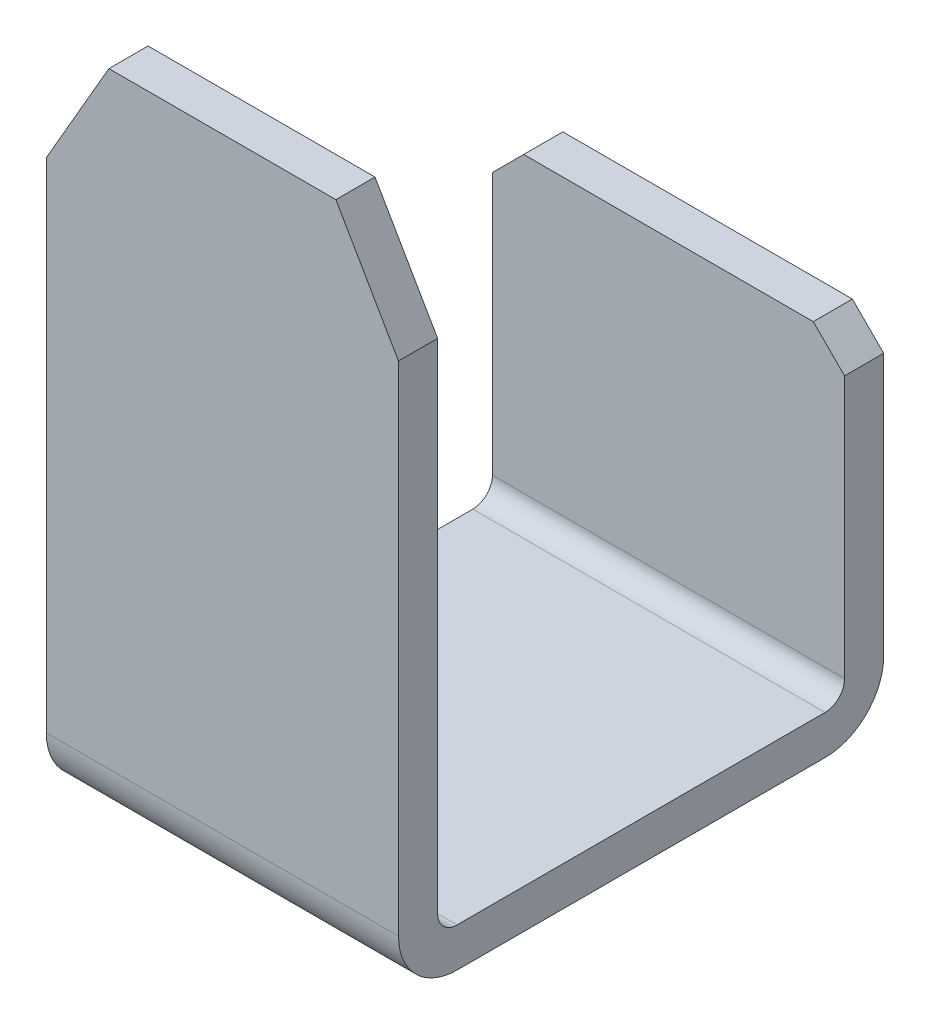
ISO-10303-21;
HEADER;
FILE_DESCRIPTION(('STEP AP214'),'2;1');
FILE_NAME('part.step','',(''),(''),'','','');
FILE_SCHEMA(('AUTOMOTIVE_DESIGN { 1 0 10303 214 1 1 1 1 }'));
ENDSEC;
DATA;
#1=APPLICATION_CONTEXT('core data for automotive mechanical design processes');
#2=APPLICATION_PROTOCOL_DEFINITION('international standard','automotive_design',2000,#1);
#3=PRODUCT_CONTEXT('',#1,'mechanical');
#4=PRODUCT('Part','Part','',(#3));
#5=PRODUCT_RELATED_PRODUCT_CATEGORY('part','',(#4));
#6=PRODUCT_DEFINITION_FORMATION('','',#4);
#7=PRODUCT_DEFINITION_CONTEXT('part definition',#1,'design');
#8=PRODUCT_DEFINITION('design','',#6,#7);
#9=PRODUCT_DEFINITION_SHAPE('','',#8);
#10=(LENGTH_UNIT() NAMED_UNIT(*) SI_UNIT(.MILLI.,.METRE.));
#11=(NAMED_UNIT(*) PLANE_ANGLE_UNIT() SI_UNIT($,.RADIAN.));
#12=(NAMED_UNIT(*) SI_UNIT($,.STERADIAN.) SOLID_ANGLE_UNIT());
#13=UNCERTAINTY_MEASURE_WITH_UNIT(LENGTH_MEASURE(1.E-05),#10,'distance_accuracy_value','');
#14=(GEOMETRIC_REPRESENTATION_CONTEXT(3) GLOBAL_UNCERTAINTY_ASSIGNED_CONTEXT((#13)) GLOBAL_UNIT_ASSIGNED_CONTEXT((#10,
#11,#12)) REPRESENTATION_CONTEXT('',''));
#15=CARTESIAN_POINT('',(0.,0.,0.));
#16=DIRECTION('',(0.,0.,1.));
#17=DIRECTION('',(1.,0.,0.));
#18=AXIS2_PLACEMENT_3D('',#15,#16,#17);
#19=CARTESIAN_POINT('',(14.2875,28.575,-19.685));
#20=DIRECTION('',(0.,0.,-1.));
#21=DIRECTION('',(0.,1.,0.));
#22=AXIS2_PLACEMENT_3D('',#19,#20,#21);
#23=PLANE('',#22);
#24=DIRECTION('',(0.,1.,0.));
#25=VECTOR('',#24,1.);
#26=CARTESIAN_POINT('',(14.2875,28.575,-19.685));
#27=LINE('',#26,#25);
#28=CARTESIAN_POINT('',(14.2875,4.76250000000002,-19.685));
#29=VERTEX_POINT('',#28);
#30=CARTESIAN_POINT('',(14.2875,26.035,-19.685));
#31=VERTEX_POINT('',#30);
#32=EDGE_CURVE('E198',#29,#31,#27,.T.);
#33=ORIENTED_EDGE('',*,*,#32,.F.);
#34=DIRECTION('',(1.,0.,0.));
#35=VECTOR('',#34,1.);
#36=CARTESIAN_POINT('',(14.2875,4.76250000000002,-19.685));
#37=LINE('',#36,#35);
#38=CARTESIAN_POINT('',(-14.2875,4.76250000000002,-19.685));
#39=VERTEX_POINT('',#38);
#40=EDGE_CURVE('E200',#39,#29,#37,.T.);
#41=ORIENTED_EDGE('',*,*,#40,.F.);
#42=DIRECTION('',(0.,1.,0.));
#43=VECTOR('',#42,1.);
#44=CARTESIAN_POINT('',(-14.2875,28.575,-19.685));
#45=LINE('',#44,#43);
#46=CARTESIAN_POINT('',(-14.2875,26.035,-19.685));
#47=VERTEX_POINT('',#46);
#48=EDGE_CURVE('E85',#39,#47,#45,.T.);
#49=ORIENTED_EDGE('',*,*,#48,.T.);
#50=DIRECTION('',(-0.707106781186548,-0.707106781186548,0.));
#51=VECTOR('',#50,1.);
#52=CARTESIAN_POINT('',(-11.7475,28.575,-19.685));
#53=LINE('',#52,#51);
#54=CARTESIAN_POINT('',(-11.7475,28.575,-19.685));
#55=VERTEX_POINT('',#54);
#56=EDGE_CURVE('E115',#55,#47,#53,.T.);
#57=ORIENTED_EDGE('',*,*,#56,.F.);
#58=DIRECTION('',(1.,0.,0.));
#59=VECTOR('',#58,1.);
#60=CARTESIAN_POINT('',(14.2875,28.575,-19.685));
#61=LINE('',#60,#59);
#62=CARTESIAN_POINT('',(11.7475,28.575,-19.685));
#63=VERTEX_POINT('',#62);
#64=EDGE_CURVE('E119',#55,#63,#61,.T.);
#65=ORIENTED_EDGE('',*,*,#64,.T.);
#66=DIRECTION('',(0.707106781186549,-0.707106781186547,0.));
#67=VECTOR('',#66,1.);
#68=CARTESIAN_POINT('',(14.2875,26.035,-19.685));
#69=LINE('',#68,#67);
#70=EDGE_CURVE('E143',#63,#31,#69,.T.);
#71=ORIENTED_EDGE('',*,*,#70,.T.);
#72=EDGE_LOOP('',(#33,#41,#49,#57,#65,#71));
#73=FACE_BOUND('',#72,.T.);
#74=ADVANCED_FACE('F16',(#73),#23,.T.);
#75=CARTESIAN_POINT('',(-11.7475,28.575,-16.51));
#76=DIRECTION('',(-0.707106781186548,0.707106781186548,0.));
#77=DIRECTION('',(-0.707106781186548,-0.707106781186548,0.));
#78=AXIS2_PLACEMENT_3D('',#75,#76,#77);
#79=PLANE('',#78);
#80=DIRECTION('',(0.,0.,-1.));
#81=VECTOR('',#80,1.);
#82=CARTESIAN_POINT('',(-14.2875,26.035,-16.51));
#83=LINE('',#82,#81);
#84=CARTESIAN_POINT('',(-14.2875,26.035,-16.51));
#85=VERTEX_POINT('',#84);
#86=EDGE_CURVE('E204',#47,#85,#83,.F.);
#87=ORIENTED_EDGE('',*,*,#86,.T.);
#88=DIRECTION('',(0.707106781186548,0.707106781186547,0.));
#89=VECTOR('',#88,1.);
#90=CARTESIAN_POINT('',(-14.2875,26.035,-16.51));
#91=LINE('',#90,#89);
#92=CARTESIAN_POINT('',(-11.7475,28.575,-16.51));
#93=VERTEX_POINT('',#92);
#94=EDGE_CURVE('E135',#85,#93,#91,.T.);
#95=ORIENTED_EDGE('',*,*,#94,.T.);
#96=DIRECTION('',(0.,0.,-1.));
#97=VECTOR('',#96,1.);
#98=CARTESIAN_POINT('',(-11.7475,28.575,-16.51));
#99=LINE('',#98,#97);
#100=EDGE_CURVE('E124',#93,#55,#99,.T.);
#101=ORIENTED_EDGE('',*,*,#100,.T.);
#102=ORIENTED_EDGE('',*,*,#56,.T.);
#103=EDGE_LOOP('',(#87,#95,#101,#102));
#104=FACE_BOUND('',#103,.T.);
#105=ADVANCED_FACE('F134',(#104),#79,.T.);
#106=CARTESIAN_POINT('',(14.2875,28.575,-16.51));
#107=DIRECTION('',(0.,-1.,0.));
#108=DIRECTION('',(0.,0.,-1.));
#109=AXIS2_PLACEMENT_3D('',#106,#107,#108);
#110=PLANE('',#109);
#111=ORIENTED_EDGE('',*,*,#64,.F.);
#112=ORIENTED_EDGE('',*,*,#100,.F.);
#113=DIRECTION('',(1.,0.,0.));
#114=VECTOR('',#113,1.);
#115=CARTESIAN_POINT('',(14.2875,28.575,-16.51));
#116=LINE('',#115,#114);
#117=CARTESIAN_POINT('',(11.7475,28.575,-16.51));
#118=VERTEX_POINT('',#117);
#119=EDGE_CURVE('E212',#93,#118,#116,.T.);
#120=ORIENTED_EDGE('',*,*,#119,.T.);
#121=DIRECTION('',(0.,0.,1.));
#122=VECTOR('',#121,1.);
#123=CARTESIAN_POINT('',(11.7475,28.575,-16.51));
#124=LINE('',#123,#122);
#125=EDGE_CURVE('E131',#118,#63,#124,.F.);
#126=ORIENTED_EDGE('',*,*,#125,.T.);
#127=EDGE_LOOP('',(#111,#112,#120,#126));
#128=FACE_BOUND('',#127,.T.);
#129=ADVANCED_FACE('F128',(#128),#110,.F.);
#130=CARTESIAN_POINT('',(14.2875,26.035,-16.51));
#131=DIRECTION('',(-0.707106781186547,-0.707106781186549,0.));
#132=DIRECTION('',(0.707106781186549,-0.707106781186547,0.));
#133=AXIS2_PLACEMENT_3D('',#130,#131,#132);
#134=PLANE('',#133);
#135=ORIENTED_EDGE('',*,*,#70,.F.);
#136=ORIENTED_EDGE('',*,*,#125,.F.);
#137=DIRECTION('',(0.707106781186549,-0.707106781186547,0.));
#138=VECTOR('',#137,1.);
#139=CARTESIAN_POINT('',(11.7475,28.575,-16.51));
#140=LINE('',#139,#138);
#141=CARTESIAN_POINT('',(14.2875,26.035,-16.51));
#142=VERTEX_POINT('',#141);
#143=EDGE_CURVE('E191',#118,#142,#140,.T.);
#144=ORIENTED_EDGE('',*,*,#143,.T.);
#145=DIRECTION('',(0.,0.,-1.));
#146=VECTOR('',#145,1.);
#147=CARTESIAN_POINT('',(14.2875,26.035,-16.51));
#148=LINE('',#147,#146);
#149=EDGE_CURVE('E92',#31,#142,#148,.F.);
#150=ORIENTED_EDGE('',*,*,#149,.F.);
#151=EDGE_LOOP('',(#135,#136,#144,#150));
#152=FACE_BOUND('',#151,.T.);
#153=ADVANCED_FACE('F228',(#152),#134,.F.);
#154=CARTESIAN_POINT('',(14.2875,4.76250000000002,-14.9225));
#155=DIRECTION('',(1.,0.,0.));
#156=DIRECTION('',(0.,0.,-1.));
#157=AXIS2_PLACEMENT_3D('',#154,#155,#156);
#158=CYLINDRICAL_SURFACE('',#157,4.7625);
#159=CARTESIAN_POINT('',(-14.2875,4.76250000000002,-14.9225));
#160=DIRECTION('',(1.,0.,0.));
#161=DIRECTION('',(0.,0.,-1.));
#162=AXIS2_PLACEMENT_3D('',#159,#160,#161);
#163=CIRCLE('',#162,4.7625);
#164=CARTESIAN_POINT('',(-14.2875,0.,-14.9225));
#165=VERTEX_POINT('',#164);
#166=EDGE_CURVE('E19',#39,#165,#163,.F.);
#167=ORIENTED_EDGE('',*,*,#166,.F.);
#168=ORIENTED_EDGE('',*,*,#40,.T.);
#169=CARTESIAN_POINT('',(14.2875,4.76250000000002,-14.9225));
#170=DIRECTION('',(1.,0.,0.));
#171=DIRECTION('',(0.,0.,-1.));
#172=AXIS2_PLACEMENT_3D('',#169,#170,#171);
#173=CIRCLE('',#172,4.7625);
#174=CARTESIAN_POINT('',(14.2875,0.,-14.9225));
#175=VERTEX_POINT('',#174);
#176=EDGE_CURVE('E173',#175,#29,#173,.T.);
#177=ORIENTED_EDGE('',*,*,#176,.F.);
#178=DIRECTION('',(1.,0.,0.));
#179=VECTOR('',#178,1.);
#180=CARTESIAN_POINT('',(14.2875,0.,-14.9225));
#181=LINE('',#180,#179);
#182=EDGE_CURVE('E175',#165,#175,#181,.T.);
#183=ORIENTED_EDGE('',*,*,#182,.F.);
#184=EDGE_LOOP('',(#167,#168,#177,#183));
#185=FACE_BOUND('',#184,.T.);
#186=ADVANCED_FACE('F286',(#185),#158,.T.);
#187=CARTESIAN_POINT('',(14.2875,28.575,-16.51));
#188=DIRECTION('',(0.,0.,-1.));
#189=DIRECTION('',(0.,1.,0.));
#190=AXIS2_PLACEMENT_3D('',#187,#188,#189);
#191=PLANE('',#190);
#192=DIRECTION('',(1.,0.,0.));
#193=VECTOR('',#192,1.);
#194=CARTESIAN_POINT('',(14.2875,4.76250000000002,-16.51));
#195=LINE('',#194,#193);
#196=CARTESIAN_POINT('',(-14.2875,4.76250000000002,-16.51));
#197=VERTEX_POINT('',#196);
#198=CARTESIAN_POINT('',(14.2875,4.76250000000002,-16.51));
#199=VERTEX_POINT('',#198);
#200=EDGE_CURVE('E170',#197,#199,#195,.T.);
#201=ORIENTED_EDGE('',*,*,#200,.T.);
#202=DIRECTION('',(0.,1.,0.));
#203=VECTOR('',#202,1.);
#204=CARTESIAN_POINT('',(14.2875,28.575,-16.51));
#205=LINE('',#204,#203);
#206=EDGE_CURVE('E189',#142,#199,#205,.F.);
#207=ORIENTED_EDGE('',*,*,#206,.F.);
#208=ORIENTED_EDGE('',*,*,#143,.F.);
#209=ORIENTED_EDGE('',*,*,#119,.F.);
#210=ORIENTED_EDGE('',*,*,#94,.F.);
#211=DIRECTION('',(0.,1.,0.));
#212=VECTOR('',#211,1.);
#213=CARTESIAN_POINT('',(-14.2875,28.575,-16.51));
#214=LINE('',#213,#212);
#215=EDGE_CURVE('E183',#197,#85,#214,.T.);
#216=ORIENTED_EDGE('',*,*,#215,.F.);
#217=EDGE_LOOP('',(#201,#207,#208,#209,#210,#216));
#218=FACE_BOUND('',#217,.T.);
#219=ADVANCED_FACE('F226',(#218),#191,.F.);
#220=CARTESIAN_POINT('',(14.2875,0.,-16.51));
#221=DIRECTION('',(0.,-1.,0.));
#222=DIRECTION('',(0.,0.,-1.));
#223=AXIS2_PLACEMENT_3D('',#220,#221,#222);
#224=PLANE('',#223);
#225=DIRECTION('',(0.,0.,-1.));
#226=VECTOR('',#225,1.);
#227=CARTESIAN_POINT('',(14.2875,0.,-16.51));
#228=LINE('',#227,#226);
#229=CARTESIAN_POINT('',(14.2875,0.,14.9225));
#230=VERTEX_POINT('',#229);
#231=EDGE_CURVE('E166',#230,#175,#228,.T.);
#232=ORIENTED_EDGE('',*,*,#231,.F.);
#233=DIRECTION('',(1.,0.,0.));
#234=VECTOR('',#233,1.);
#235=CARTESIAN_POINT('',(14.2875,0.,14.9225));
#236=LINE('',#235,#234);
#237=CARTESIAN_POINT('',(-14.2875,0.,14.9225));
#238=VERTEX_POINT('',#237);
#239=EDGE_CURVE('E417',#238,#230,#236,.T.);
#240=ORIENTED_EDGE('',*,*,#239,.F.);
#241=DIRECTION('',(0.,0.,-1.));
#242=VECTOR('',#241,1.);
#243=CARTESIAN_POINT('',(-14.2875,0.,-16.51));
#244=LINE('',#243,#242);
#245=EDGE_CURVE('E169',#238,#165,#244,.T.);
#246=ORIENTED_EDGE('',*,*,#245,.T.);
#247=ORIENTED_EDGE('',*,*,#182,.T.);
#248=EDGE_LOOP('',(#232,#240,#246,#247));
#249=FACE_BOUND('',#248,.T.);
#250=ADVANCED_FACE('F280',(#249),#224,.T.);
#251=CARTESIAN_POINT('',(14.2875,4.76250000000002,-14.9225));
#252=DIRECTION('',(1.,0.,0.));
#253=DIRECTION('',(0.,0.,-1.));
#254=AXIS2_PLACEMENT_3D('',#251,#252,#253);
#255=CYLINDRICAL_SURFACE('',#254,1.5875);
#256=ORIENTED_EDGE('',*,*,#200,.F.);
#257=CARTESIAN_POINT('',(-14.2875,4.76250000000002,-14.9225));
#258=DIRECTION('',(1.,0.,0.));
#259=DIRECTION('',(0.,0.,-1.));
#260=AXIS2_PLACEMENT_3D('',#257,#258,#259);
#261=CIRCLE('',#260,1.5875);
#262=CARTESIAN_POINT('',(-14.2875,3.17500000000002,-14.9225));
#263=VERTEX_POINT('',#262);
#264=EDGE_CURVE('E171',#263,#197,#261,.T.);
#265=ORIENTED_EDGE('',*,*,#264,.F.);
#266=DIRECTION('',(1.,0.,0.));
#267=VECTOR('',#266,1.);
#268=CARTESIAN_POINT('',(14.2875,3.17500000000002,-14.9225));
#269=LINE('',#268,#267);
#270=CARTESIAN_POINT('',(14.2875,3.17500000000002,-14.9225));
#271=VERTEX_POINT('',#270);
#272=EDGE_CURVE('E165',#263,#271,#269,.T.);
#273=ORIENTED_EDGE('',*,*,#272,.T.);
#274=CARTESIAN_POINT('',(14.2875,4.76250000000002,-14.9225));
#275=DIRECTION('',(1.,0.,0.));
#276=DIRECTION('',(0.,0.,-1.));
#277=AXIS2_PLACEMENT_3D('',#274,#275,#276);
#278=CIRCLE('',#277,1.5875);
#279=EDGE_CURVE('E167',#199,#271,#278,.F.);
#280=ORIENTED_EDGE('',*,*,#279,.F.);
#281=EDGE_LOOP('',(#256,#265,#273,#280));
#282=FACE_BOUND('',#281,.T.);
#283=ADVANCED_FACE('F276',(#282),#255,.F.);
#284=CARTESIAN_POINT('',(14.2875,4.7625,14.9225));
#285=DIRECTION('',(1.,0.,0.));
#286=DIRECTION('',(0.,0.,-1.));
#287=AXIS2_PLACEMENT_3D('',#284,#285,#286);
#288=CYLINDRICAL_SURFACE('',#287,4.7625);
#289=CARTESIAN_POINT('',(-14.2875,4.7625,14.9225));
#290=DIRECTION('',(1.,0.,0.));
#291=DIRECTION('',(0.,0.,-1.));
#292=AXIS2_PLACEMENT_3D('',#289,#290,#291);
#293=CIRCLE('',#292,4.7625);
#294=CARTESIAN_POINT('',(-14.2875,4.7625,19.685));
#295=VERTEX_POINT('',#294);
#296=EDGE_CURVE('E163',#238,#295,#293,.F.);
#297=ORIENTED_EDGE('',*,*,#296,.F.);
#298=ORIENTED_EDGE('',*,*,#239,.T.);
#299=CARTESIAN_POINT('',(14.2875,4.7625,14.9225));
#300=DIRECTION('',(1.,0.,0.));
#301=DIRECTION('',(0.,0.,-1.));
#302=AXIS2_PLACEMENT_3D('',#299,#300,#301);
#303=CIRCLE('',#302,4.7625);
#304=CARTESIAN_POINT('',(14.2875,4.7625,19.685));
#305=VERTEX_POINT('',#304);
#306=EDGE_CURVE('E158',#305,#230,#303,.T.);
#307=ORIENTED_EDGE('',*,*,#306,.F.);
#308=DIRECTION('',(1.,0.,0.));
#309=VECTOR('',#308,1.);
#310=CARTESIAN_POINT('',(14.2875,4.7625,19.685));
#311=LINE('',#310,#309);
#312=EDGE_CURVE('E162',#295,#305,#311,.T.);
#313=ORIENTED_EDGE('',*,*,#312,.F.);
#314=EDGE_LOOP('',(#297,#298,#307,#313));
#315=FACE_BOUND('',#314,.T.);
#316=ADVANCED_FACE('F272',(#315),#288,.T.);
#317=CARTESIAN_POINT('',(14.2875,3.17500000000002,-16.51));
#318=DIRECTION('',(0.,-1.,0.));
#319=DIRECTION('',(0.,0.,-1.));
#320=AXIS2_PLACEMENT_3D('',#317,#318,#319);
#321=PLANE('',#320);
#322=DIRECTION('',(1.,0.,0.));
#323=VECTOR('',#322,1.);
#324=CARTESIAN_POINT('',(14.2875,3.175,14.9225));
#325=LINE('',#324,#323);
#326=CARTESIAN_POINT('',(-14.2875,3.175,14.9225));
#327=VERTEX_POINT('',#326);
#328=CARTESIAN_POINT('',(14.2875,3.175,14.9225));
#329=VERTEX_POINT('',#328);
#330=EDGE_CURVE('E153',#327,#329,#325,.T.);
#331=ORIENTED_EDGE('',*,*,#330,.T.);
#332=DIRECTION('',(0.,0.,-1.));
#333=VECTOR('',#332,1.);
#334=CARTESIAN_POINT('',(14.2875,3.17500000000002,-16.51));
#335=LINE('',#334,#333);
#336=EDGE_CURVE('E465',#271,#329,#335,.F.);
#337=ORIENTED_EDGE('',*,*,#336,.F.);
#338=ORIENTED_EDGE('',*,*,#272,.F.);
#339=DIRECTION('',(0.,0.,-1.));
#340=VECTOR('',#339,1.);
#341=CARTESIAN_POINT('',(-14.2875,3.17500000000002,-16.51));
#342=LINE('',#341,#340);
#343=EDGE_CURVE('E420',#327,#263,#342,.T.);
#344=ORIENTED_EDGE('',*,*,#343,.F.);
#345=EDGE_LOOP('',(#331,#337,#338,#344));
#346=FACE_BOUND('',#345,.T.);
#347=ADVANCED_FACE('F268',(#346),#321,.F.);
#348=CARTESIAN_POINT('',(14.2875,3.175,19.685));
#349=DIRECTION('',(0.,0.,1.));
#350=DIRECTION('',(0.,-1.,0.));
#351=AXIS2_PLACEMENT_3D('',#348,#349,#350);
#352=PLANE('',#351);
#353=DIRECTION('',(0.,1.,0.));
#354=VECTOR('',#353,1.);
#355=CARTESIAN_POINT('',(-14.2875,3.175,19.685));
#356=LINE('',#355,#354);
#357=CARTESIAN_POINT('',(-14.2875,45.1761818975501,19.685));
#358=VERTEX_POINT('',#357);
#359=EDGE_CURVE('E157',#358,#295,#356,.F.);
#360=ORIENTED_EDGE('',*,*,#359,.T.);
#361=ORIENTED_EDGE('',*,*,#312,.T.);
#362=DIRECTION('',(0.,1.,0.));
#363=VECTOR('',#362,1.);
#364=CARTESIAN_POINT('',(14.2875,3.175,19.685));
#365=LINE('',#364,#363);
#366=CARTESIAN_POINT('',(14.2875,45.1761818975501,19.685));
#367=VERTEX_POINT('',#366);
#368=EDGE_CURVE('E234',#367,#305,#365,.F.);
#369=ORIENTED_EDGE('',*,*,#368,.F.);
#370=DIRECTION('',(0.500000000000002,-0.866025403784437,0.));
#371=VECTOR('',#370,1.);
#372=CARTESIAN_POINT('',(14.2875,45.1761818975501,19.685));
#373=LINE('',#372,#371);
#374=CARTESIAN_POINT('',(9.20749999999998,53.975,19.685));
#375=VERTEX_POINT('',#374);
#376=EDGE_CURVE('E161',#367,#375,#373,.F.);
#377=ORIENTED_EDGE('',*,*,#376,.T.);
#378=DIRECTION('',(1.,0.,0.));
#379=VECTOR('',#378,1.);
#380=CARTESIAN_POINT('',(14.2875,53.975,19.685));
#381=LINE('',#380,#379);
#382=CARTESIAN_POINT('',(-9.20749999999998,53.975,19.685));
#383=VERTEX_POINT('',#382);
#384=EDGE_CURVE('E451',#383,#375,#381,.T.);
#385=ORIENTED_EDGE('',*,*,#384,.F.);
#386=DIRECTION('',(-0.500000000000002,-0.866025403784437,0.));
#387=VECTOR('',#386,1.);
#388=CARTESIAN_POINT('',(-9.20749999999998,53.975,19.685));
#389=LINE('',#388,#387);
#390=EDGE_CURVE('E425',#358,#383,#389,.F.);
#391=ORIENTED_EDGE('',*,*,#390,.F.);
#392=EDGE_LOOP('',(#360,#361,#369,#377,#385,#391));
#393=FACE_BOUND('',#392,.T.);
#394=ADVANCED_FACE('F264',(#393),#352,.T.);
#395=CARTESIAN_POINT('',(14.2875,45.1761818975501,16.51));
#396=DIRECTION('',(-0.866025403784437,-0.500000000000002,0.));
#397=DIRECTION('',(0.500000000000002,-0.866025403784437,0.));
#398=AXIS2_PLACEMENT_3D('',#395,#396,#397);
#399=PLANE('',#398);
#400=ORIENTED_EDGE('',*,*,#376,.F.);
#401=DIRECTION('',(0.,0.,-1.));
#402=VECTOR('',#401,1.);
#403=CARTESIAN_POINT('',(14.2875,45.1761818975501,16.51));
#404=LINE('',#403,#402);
#405=CARTESIAN_POINT('',(14.2875,45.1761818975501,16.51));
#406=VERTEX_POINT('',#405);
#407=EDGE_CURVE('E152',#406,#367,#404,.F.);
#408=ORIENTED_EDGE('',*,*,#407,.F.);
#409=DIRECTION('',(-0.500000000000002,0.866025403784438,0.));
#410=VECTOR('',#409,1.);
#411=CARTESIAN_POINT('',(14.2875,45.1761818975501,16.51));
#412=LINE('',#411,#410);
#413=CARTESIAN_POINT('',(9.20749999999998,53.975,16.51));
#414=VERTEX_POINT('',#413);
#415=EDGE_CURVE('E489',#406,#414,#412,.T.);
#416=ORIENTED_EDGE('',*,*,#415,.T.);
#417=DIRECTION('',(0.,0.,1.));
#418=VECTOR('',#417,1.);
#419=CARTESIAN_POINT('',(9.20749999999998,53.975,16.51));
#420=LINE('',#419,#418);
#421=EDGE_CURVE('E441',#375,#414,#420,.F.);
#422=ORIENTED_EDGE('',*,*,#421,.F.);
#423=EDGE_LOOP('',(#400,#408,#416,#422));
#424=FACE_BOUND('',#423,.T.);
#425=ADVANCED_FACE('F260',(#424),#399,.F.);
#426=CARTESIAN_POINT('',(14.2875,53.975,16.51));
#427=DIRECTION('',(0.,1.,0.));
#428=DIRECTION('',(0.,0.,1.));
#429=AXIS2_PLACEMENT_3D('',#426,#427,#428);
#430=PLANE('',#429);
#431=ORIENTED_EDGE('',*,*,#421,.T.);
#432=DIRECTION('',(1.,0.,0.));
#433=VECTOR('',#432,1.);
#434=CARTESIAN_POINT('',(14.2875,53.975,16.51));
#435=LINE('',#434,#433);
#436=CARTESIAN_POINT('',(-9.20749999999998,53.975,16.51));
#437=VERTEX_POINT('',#436);
#438=EDGE_CURVE('E448',#414,#437,#435,.F.);
#439=ORIENTED_EDGE('',*,*,#438,.T.);
#440=DIRECTION('',(0.,0.,1.));
#441=VECTOR('',#440,1.);
#442=CARTESIAN_POINT('',(-9.20749999999998,53.975,16.51));
#443=LINE('',#442,#441);
#444=EDGE_CURVE('E430',#383,#437,#443,.F.);
#445=ORIENTED_EDGE('',*,*,#444,.F.);
#446=ORIENTED_EDGE('',*,*,#384,.T.);
#447=EDGE_LOOP('',(#431,#439,#445,#446));
#448=FACE_BOUND('',#447,.T.);
#449=ADVANCED_FACE('F256',(#448),#430,.T.);
#450=CARTESIAN_POINT('',(-9.20749999999998,53.975,16.51));
#451=DIRECTION('',(-0.866025403784437,0.500000000000002,0.));
#452=DIRECTION('',(-0.500000000000002,-0.866025403784437,0.));
#453=AXIS2_PLACEMENT_3D('',#450,#451,#452);
#454=PLANE('',#453);
#455=ORIENTED_EDGE('',*,*,#444,.T.);
#456=DIRECTION('',(-0.500000000000002,-0.866025403784437,0.));
#457=VECTOR('',#456,1.);
#458=CARTESIAN_POINT('',(-9.20749999999998,53.975,16.51));
#459=LINE('',#458,#457);
#460=CARTESIAN_POINT('',(-14.2875,45.1761818975501,16.51));
#461=VERTEX_POINT('',#460);
#462=EDGE_CURVE('E444',#437,#461,#459,.T.);
#463=ORIENTED_EDGE('',*,*,#462,.T.);
#464=DIRECTION('',(0.,0.,-1.));
#465=VECTOR('',#464,1.);
#466=CARTESIAN_POINT('',(-14.2875,45.1761818975501,16.51));
#467=LINE('',#466,#465);
#468=EDGE_CURVE('E428',#461,#358,#467,.F.);
#469=ORIENTED_EDGE('',*,*,#468,.T.);
#470=ORIENTED_EDGE('',*,*,#390,.T.);
#471=EDGE_LOOP('',(#455,#463,#469,#470));
#472=FACE_BOUND('',#471,.T.);
#473=ADVANCED_FACE('F253',(#472),#454,.T.);
#474=CARTESIAN_POINT('',(-14.2875,3.175,16.51));
#475=DIRECTION('',(1.,0.,0.));
#476=DIRECTION('',(0.,0.,-1.));
#477=AXIS2_PLACEMENT_3D('',#474,#475,#476);
#478=PLANE('',#477);
#479=ORIENTED_EDGE('',*,*,#359,.F.);
#480=ORIENTED_EDGE('',*,*,#468,.F.);
#481=DIRECTION('',(0.,-1.,0.));
#482=VECTOR('',#481,1.);
#483=CARTESIAN_POINT('',(-14.2875,3.175,16.51));
#484=LINE('',#483,#482);
#485=CARTESIAN_POINT('',(-14.2875,4.7625,16.51));
#486=VERTEX_POINT('',#485);
#487=EDGE_CURVE('E447',#461,#486,#484,.T.);
#488=ORIENTED_EDGE('',*,*,#487,.T.);
#489=CARTESIAN_POINT('',(-14.2875,4.7625,14.9225));
#490=DIRECTION('',(1.,0.,0.));
#491=DIRECTION('',(0.,0.,-1.));
#492=AXIS2_PLACEMENT_3D('',#489,#490,#491);
#493=CIRCLE('',#492,1.5875);
#494=EDGE_CURVE('E154',#486,#327,#493,.T.);
#495=ORIENTED_EDGE('',*,*,#494,.T.);
#496=ORIENTED_EDGE('',*,*,#343,.T.);
#497=ORIENTED_EDGE('',*,*,#264,.T.);
#498=ORIENTED_EDGE('',*,*,#215,.T.);
#499=ORIENTED_EDGE('',*,*,#86,.F.);
#500=ORIENTED_EDGE('',*,*,#48,.F.);
#501=ORIENTED_EDGE('',*,*,#166,.T.);
#502=ORIENTED_EDGE('',*,*,#245,.F.);
#503=ORIENTED_EDGE('',*,*,#296,.T.);
#504=EDGE_LOOP('',(#479,#480,#488,#495,#496,#497,#498,#499,#500,#501,#502,#503));
#505=FACE_BOUND('',#504,.T.);
#506=ADVANCED_FACE('F247',(#505),#478,.F.);
#507=CARTESIAN_POINT('',(14.2875,4.7625,14.9225));
#508=DIRECTION('',(1.,0.,0.));
#509=DIRECTION('',(0.,0.,-1.));
#510=AXIS2_PLACEMENT_3D('',#507,#508,#509);
#511=CYLINDRICAL_SURFACE('',#510,1.5875);
#512=ORIENTED_EDGE('',*,*,#330,.F.);
#513=ORIENTED_EDGE('',*,*,#494,.F.);
#514=DIRECTION('',(1.,0.,0.));
#515=VECTOR('',#514,1.);
#516=CARTESIAN_POINT('',(14.2875,4.7625,16.51));
#517=LINE('',#516,#515);
#518=CARTESIAN_POINT('',(14.2875,4.7625,16.51));
#519=VERTEX_POINT('',#518);
#520=EDGE_CURVE('E25',#486,#519,#517,.T.);
#521=ORIENTED_EDGE('',*,*,#520,.T.);
#522=CARTESIAN_POINT('',(14.2875,4.7625,14.9225));
#523=DIRECTION('',(1.,0.,0.));
#524=DIRECTION('',(0.,0.,-1.));
#525=AXIS2_PLACEMENT_3D('',#522,#523,#524);
#526=CIRCLE('',#525,1.5875);
#527=EDGE_CURVE('E33',#329,#519,#526,.F.);
#528=ORIENTED_EDGE('',*,*,#527,.F.);
#529=EDGE_LOOP('',(#512,#513,#521,#528));
#530=FACE_BOUND('',#529,.T.);
#531=ADVANCED_FACE('F238',(#530),#511,.F.);
#532=CARTESIAN_POINT('',(14.2875,3.175,16.51));
#533=DIRECTION('',(1.,0.,0.));
#534=DIRECTION('',(0.,0.,-1.));
#535=AXIS2_PLACEMENT_3D('',#532,#533,#534);
#536=PLANE('',#535);
#537=ORIENTED_EDGE('',*,*,#368,.T.);
#538=ORIENTED_EDGE('',*,*,#306,.T.);
#539=ORIENTED_EDGE('',*,*,#231,.T.);
#540=ORIENTED_EDGE('',*,*,#176,.T.);
#541=ORIENTED_EDGE('',*,*,#32,.T.);
#542=ORIENTED_EDGE('',*,*,#149,.T.);
#543=ORIENTED_EDGE('',*,*,#206,.T.);
#544=ORIENTED_EDGE('',*,*,#279,.T.);
#545=ORIENTED_EDGE('',*,*,#336,.T.);
#546=ORIENTED_EDGE('',*,*,#527,.T.);
#547=DIRECTION('',(0.,-1.,0.));
#548=VECTOR('',#547,1.);
#549=CARTESIAN_POINT('',(14.2875,3.175,16.51));
#550=LINE('',#549,#548);
#551=EDGE_CURVE('E11',#519,#406,#550,.F.);
#552=ORIENTED_EDGE('',*,*,#551,.T.);
#553=ORIENTED_EDGE('',*,*,#407,.T.);
#554=EDGE_LOOP('',(#537,#538,#539,#540,#541,#542,#543,#544,#545,#546,#552,#553));
#555=FACE_BOUND('',#554,.T.);
#556=ADVANCED_FACE('F231',(#555),#536,.T.);
#557=CARTESIAN_POINT('',(14.2875,3.175,16.51));
#558=DIRECTION('',(0.,0.,1.));
#559=DIRECTION('',(0.,-1.,0.));
#560=AXIS2_PLACEMENT_3D('',#557,#558,#559);
#561=PLANE('',#560);
#562=ORIENTED_EDGE('',*,*,#520,.F.);
#563=ORIENTED_EDGE('',*,*,#487,.F.);
#564=ORIENTED_EDGE('',*,*,#462,.F.);
#565=ORIENTED_EDGE('',*,*,#438,.F.);
#566=ORIENTED_EDGE('',*,*,#415,.F.);
#567=ORIENTED_EDGE('',*,*,#551,.F.);
#568=EDGE_LOOP('',(#562,#563,#564,#565,#566,#567));
#569=FACE_BOUND('',#568,.T.);
#570=ADVANCED_FACE('F237',(#569),#561,.F.);
#571=CLOSED_SHELL('',(#74,#105,#129,#153,#186,#219,#250,#283,#316,#347,#394,#425,#449,#473,#506,
#531,#556,#570));
#572=MANIFOLD_SOLID_BREP('B1',#571);
#573=ADVANCED_BREP_SHAPE_REPRESENTATION('',(#18,#572),#14);
#574=SHAPE_DEFINITION_REPRESENTATION(#9,#573);
ENDSEC;
END-ISO-10303-21;
